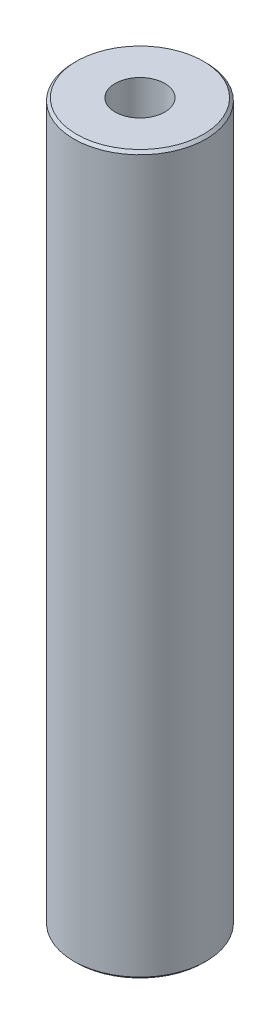
ISO-10303-21;
HEADER;
FILE_DESCRIPTION(('STEP AP214'),'2;1');
FILE_NAME('part.step','',(''),(''),'','','');
FILE_SCHEMA(('AUTOMOTIVE_DESIGN { 1 0 10303 214 1 1 1 1 }'));
ENDSEC;
DATA;
#1=APPLICATION_CONTEXT('core data for automotive mechanical design processes');
#2=APPLICATION_PROTOCOL_DEFINITION('international standard','automotive_design',2000,#1);
#3=PRODUCT_CONTEXT('',#1,'mechanical');
#4=PRODUCT('Part','Part','',(#3));
#5=PRODUCT_RELATED_PRODUCT_CATEGORY('part','',(#4));
#6=PRODUCT_DEFINITION_FORMATION('','',#4);
#7=PRODUCT_DEFINITION_CONTEXT('part definition',#1,'design');
#8=PRODUCT_DEFINITION('design','',#6,#7);
#9=PRODUCT_DEFINITION_SHAPE('','',#8);
#10=(LENGTH_UNIT() NAMED_UNIT(*) SI_UNIT(.MILLI.,.METRE.));
#11=(NAMED_UNIT(*) PLANE_ANGLE_UNIT() SI_UNIT($,.RADIAN.));
#12=(NAMED_UNIT(*) SI_UNIT($,.STERADIAN.) SOLID_ANGLE_UNIT());
#13=UNCERTAINTY_MEASURE_WITH_UNIT(LENGTH_MEASURE(1.E-05),#10,'distance_accuracy_value','');
#14=(GEOMETRIC_REPRESENTATION_CONTEXT(3) GLOBAL_UNCERTAINTY_ASSIGNED_CONTEXT((#13)) GLOBAL_UNIT_ASSIGNED_CONTEXT((#10,
#11,#12)) REPRESENTATION_CONTEXT('',''));
#15=CARTESIAN_POINT('',(0.,0.,0.));
#16=DIRECTION('',(0.,0.,1.));
#17=DIRECTION('',(1.,0.,0.));
#18=AXIS2_PLACEMENT_3D('',#15,#16,#17);
#19=CARTESIAN_POINT('',(0.,570.04785929325,0.));
#20=DIRECTION('',(0.,-1.,0.));
#21=DIRECTION('',(0.,0.,-1.));
#22=AXIS2_PLACEMENT_3D('',#19,#20,#21);
#23=CYLINDRICAL_SURFACE('',#22,52.5);
#24=CARTESIAN_POINT('',(0.,567.905763717934,0.));
#25=DIRECTION('',(0.,1.,0.));
#26=DIRECTION('',(0.,0.,1.));
#27=AXIS2_PLACEMENT_3D('',#24,#25,#26);
#28=CIRCLE('',#27,52.5);
#29=CARTESIAN_POINT('',(0.,567.905763717934,52.5));
#30=VERTEX_POINT('',#29);
#31=EDGE_CURVE('E50',#30,#30,#28,.F.);
#32=ORIENTED_EDGE('',*,*,#31,.T.);
#33=EDGE_LOOP('',(#32));
#34=FACE_BOUND('',#33,.T.);
#35=CARTESIAN_POINT('',(0.,2.14209557531575,0.));
#36=DIRECTION('',(0.,1.,0.));
#37=DIRECTION('',(0.,0.,1.));
#38=AXIS2_PLACEMENT_3D('',#35,#36,#37);
#39=CIRCLE('',#38,52.5);
#40=CARTESIAN_POINT('',(0.,2.14209557531575,52.5));
#41=VERTEX_POINT('',#40);
#42=EDGE_CURVE('E51',#41,#41,#39,.T.);
#43=ORIENTED_EDGE('',*,*,#42,.T.);
#44=EDGE_LOOP('',(#43));
#45=FACE_BOUND('',#44,.T.);
#46=ADVANCED_FACE('F39',(#34,#45),#23,.T.);
#47=CARTESIAN_POINT('',(0.,570.04785929325,0.));
#48=DIRECTION('',(0.,1.,0.));
#49=DIRECTION('',(0.,0.,1.));
#50=AXIS2_PLACEMENT_3D('',#47,#48,#49);
#51=PLANE('',#50);
#52=CARTESIAN_POINT('',(0.,570.04785929325,0.));
#53=DIRECTION('',(0.,1.,0.));
#54=DIRECTION('',(0.,0.,1.));
#55=AXIS2_PLACEMENT_3D('',#52,#53,#54);
#56=CIRCLE('',#55,50.3579044246841);
#57=CARTESIAN_POINT('',(0.,570.04785929325,50.3579044246841));
#58=VERTEX_POINT('',#57);
#59=EDGE_CURVE('E54',#58,#58,#56,.T.);
#60=ORIENTED_EDGE('',*,*,#59,.T.);
#61=EDGE_LOOP('',(#60));
#62=FACE_BOUND('',#61,.T.);
#63=CARTESIAN_POINT('',(0.,570.04785929325,0.));
#64=DIRECTION('',(0.,1.,0.));
#65=DIRECTION('',(0.,0.,1.));
#66=AXIS2_PLACEMENT_3D('',#63,#64,#65);
#67=CIRCLE('',#66,19.7284199572761);
#68=CARTESIAN_POINT('',(0.,570.04785929325,19.7284199572761));
#69=VERTEX_POINT('',#68);
#70=EDGE_CURVE('E58',#69,#69,#67,.T.);
#71=ORIENTED_EDGE('',*,*,#70,.F.);
#72=EDGE_LOOP('',(#71));
#73=FACE_BOUND('',#72,.T.);
#74=ADVANCED_FACE('F69',(#62,#73),#51,.T.);
#75=CARTESIAN_POINT('',(0.,0.,0.));
#76=DIRECTION('',(0.,1.,0.));
#77=DIRECTION('',(0.,0.,1.));
#78=AXIS2_PLACEMENT_3D('',#75,#76,#77);
#79=PLANE('',#78);
#80=CARTESIAN_POINT('',(0.,0.,0.));
#81=DIRECTION('',(0.,1.,0.));
#82=DIRECTION('',(0.,0.,1.));
#83=AXIS2_PLACEMENT_3D('',#80,#81,#82);
#84=CIRCLE('',#83,50.3579044246842);
#85=CARTESIAN_POINT('',(0.,0.,50.3579044246842));
#86=VERTEX_POINT('',#85);
#87=EDGE_CURVE('E10',#86,#86,#84,.F.);
#88=ORIENTED_EDGE('',*,*,#87,.T.);
#89=EDGE_LOOP('',(#88));
#90=FACE_BOUND('',#89,.T.);
#91=CARTESIAN_POINT('',(0.,0.,0.));
#92=DIRECTION('',(0.,1.,0.));
#93=DIRECTION('',(0.,0.,1.));
#94=AXIS2_PLACEMENT_3D('',#91,#92,#93);
#95=CIRCLE('',#94,19.7284199572761);
#96=CARTESIAN_POINT('',(0.,0.,19.7284199572761));
#97=VERTEX_POINT('',#96);
#98=EDGE_CURVE('E63',#97,#97,#95,.T.);
#99=ORIENTED_EDGE('',*,*,#98,.T.);
#100=EDGE_LOOP('',(#99));
#101=FACE_BOUND('',#100,.T.);
#102=ADVANCED_FACE('F75',(#90,#101),#79,.F.);
#103=CARTESIAN_POINT('',(0.,570.04785929325,0.));
#104=DIRECTION('',(0.,-1.,0.));
#105=DIRECTION('',(0.,0.,-1.));
#106=AXIS2_PLACEMENT_3D('',#103,#104,#105);
#107=CYLINDRICAL_SURFACE('',#106,19.7284199572761);
#108=ORIENTED_EDGE('',*,*,#70,.T.);
#109=EDGE_LOOP('',(#108));
#110=FACE_BOUND('',#109,.T.);
#111=ORIENTED_EDGE('',*,*,#98,.F.);
#112=EDGE_LOOP('',(#111));
#113=FACE_BOUND('',#112,.T.);
#114=ADVANCED_FACE('F70',(#110,#113),#107,.F.);
#115=CARTESIAN_POINT('',(0.,570.04785929325,0.));
#116=DIRECTION('',(0.,-1.,0.));
#117=DIRECTION('',(0.,0.,-1.));
#118=AXIS2_PLACEMENT_3D('',#115,#116,#117);
#119=CONICAL_SURFACE('',#118,50.3579044246841,0.785398163397437);
#120=ORIENTED_EDGE('',*,*,#31,.F.);
#121=EDGE_LOOP('',(#120));
#122=FACE_BOUND('',#121,.T.);
#123=ORIENTED_EDGE('',*,*,#59,.F.);
#124=EDGE_LOOP('',(#123));
#125=FACE_BOUND('',#124,.T.);
#126=ADVANCED_FACE('F81',(#122,#125),#119,.T.);
#127=CARTESIAN_POINT('',(0.,2.14209557531575,0.));
#128=DIRECTION('',(0.,1.,0.));
#129=DIRECTION('',(0.,0.,1.));
#130=AXIS2_PLACEMENT_3D('',#127,#128,#129);
#131=CONICAL_SURFACE('',#130,52.5,0.78539816339745);
#132=ORIENTED_EDGE('',*,*,#87,.F.);
#133=EDGE_LOOP('',(#132));
#134=FACE_BOUND('',#133,.T.);
#135=ORIENTED_EDGE('',*,*,#42,.F.);
#136=EDGE_LOOP('',(#135));
#137=FACE_BOUND('',#136,.T.);
#138=ADVANCED_FACE('F45',(#134,#137),#131,.T.);
#139=CLOSED_SHELL('',(#46,#74,#102,#114,#126,#138));
#140=MANIFOLD_SOLID_BREP('B2',#139);
#141=ADVANCED_BREP_SHAPE_REPRESENTATION('',(#18,#140),#14);
#142=SHAPE_DEFINITION_REPRESENTATION(#9,#141);
ENDSEC;
END-ISO-10303-21;
